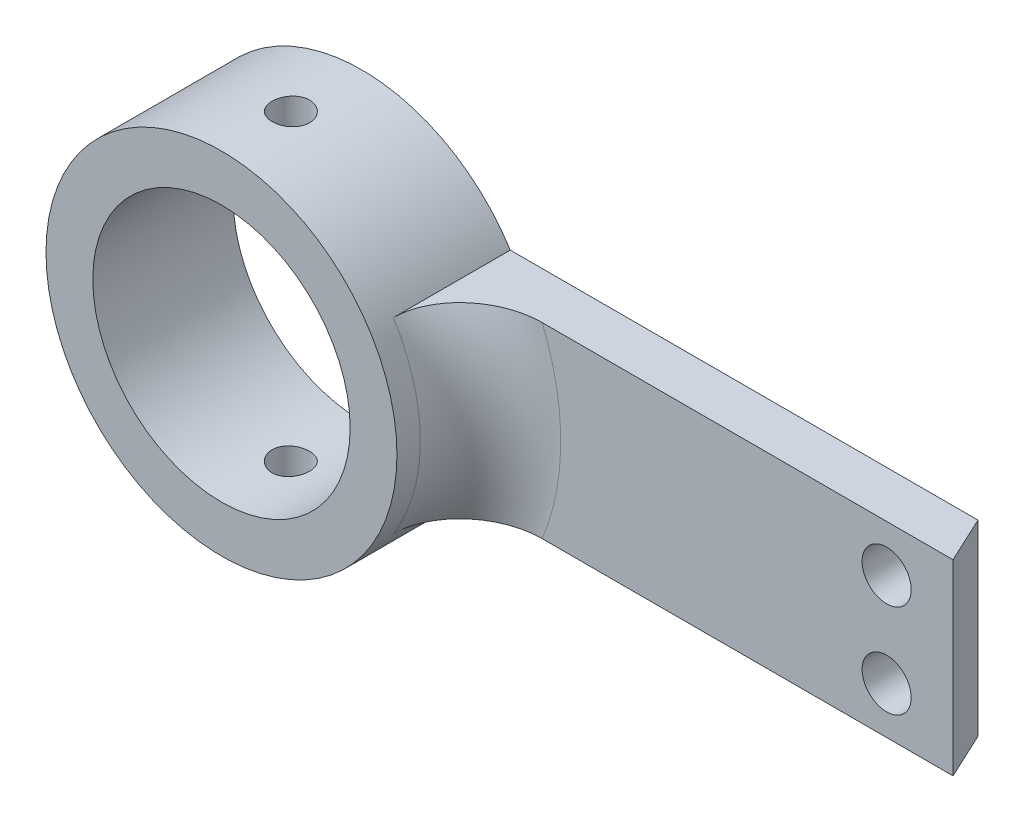
ISO-10303-21;
HEADER;
FILE_DESCRIPTION(('STEP AP214'),'2;1');
FILE_NAME('part.step','',(''),(''),'','','');
FILE_SCHEMA(('AUTOMOTIVE_DESIGN { 1 0 10303 214 1 1 1 1 }'));
ENDSEC;
DATA;
#1=APPLICATION_CONTEXT('core data for automotive mechanical design processes');
#2=APPLICATION_PROTOCOL_DEFINITION('international standard','automotive_design',2000,#1);
#3=PRODUCT_CONTEXT('',#1,'mechanical');
#4=PRODUCT('Part','Part','',(#3));
#5=PRODUCT_RELATED_PRODUCT_CATEGORY('part','',(#4));
#6=PRODUCT_DEFINITION_FORMATION('','',#4);
#7=PRODUCT_DEFINITION_CONTEXT('part definition',#1,'design');
#8=PRODUCT_DEFINITION('design','',#6,#7);
#9=PRODUCT_DEFINITION_SHAPE('','',#8);
#10=(LENGTH_UNIT() NAMED_UNIT(*) SI_UNIT(.MILLI.,.METRE.));
#11=(NAMED_UNIT(*) PLANE_ANGLE_UNIT() SI_UNIT($,.RADIAN.));
#12=(NAMED_UNIT(*) SI_UNIT($,.STERADIAN.) SOLID_ANGLE_UNIT());
#13=UNCERTAINTY_MEASURE_WITH_UNIT(LENGTH_MEASURE(1.E-05),#10,'distance_accuracy_value','');
#14=(GEOMETRIC_REPRESENTATION_CONTEXT(3) GLOBAL_UNCERTAINTY_ASSIGNED_CONTEXT((#13)) GLOBAL_UNIT_ASSIGNED_CONTEXT((#10,
#11,#12)) REPRESENTATION_CONTEXT('',''));
#15=CARTESIAN_POINT('',(0.,0.,0.));
#16=DIRECTION('',(0.,0.,1.));
#17=DIRECTION('',(1.,0.,0.));
#18=AXIS2_PLACEMENT_3D('',#15,#16,#17);
#19=CARTESIAN_POINT('',(21.9969620581679,8.,0.));
#20=DIRECTION('',(0.,0.,-1.));
#21=DIRECTION('',(-1.,0.,0.));
#22=AXIS2_PLACEMENT_3D('',#19,#20,#21);
#23=PLANE('',#22);
#24=CARTESIAN_POINT('',(24.4295773744779,2.,0.));
#25=DIRECTION('',(0.,0.,1.));
#26=DIRECTION('',(1.,0.,0.));
#27=AXIS2_PLACEMENT_3D('',#24,#25,#26);
#28=CIRCLE('',#27,1.05);
#29=CARTESIAN_POINT('',(25.4795773744779,2.,0.));
#30=VERTEX_POINT('',#29);
#31=EDGE_CURVE('E231',#30,#30,#28,.T.);
#32=ORIENTED_EDGE('',*,*,#31,.F.);
#33=EDGE_LOOP('',(#32));
#34=FACE_BOUND('',#33,.T.);
#35=CARTESIAN_POINT('',(24.4295773744779,6.,0.));
#36=DIRECTION('',(0.,0.,1.));
#37=DIRECTION('',(1.,0.,0.));
#38=AXIS2_PLACEMENT_3D('',#35,#36,#37);
#39=CIRCLE('',#38,1.05);
#40=CARTESIAN_POINT('',(25.4795773744779,6.,0.));
#41=VERTEX_POINT('',#40);
#42=EDGE_CURVE('E179',#41,#41,#39,.T.);
#43=ORIENTED_EDGE('',*,*,#42,.F.);
#44=EDGE_LOOP('',(#43));
#45=FACE_BOUND('',#44,.T.);
#46=DIRECTION('',(1.,0.,0.));
#47=VECTOR('',#46,1.);
#48=CARTESIAN_POINT('',(0.,8.,0.));
#49=LINE('',#48,#47);
#50=CARTESIAN_POINT('',(9.7082439194738,8.,0.));
#51=VERTEX_POINT('',#50);
#52=CARTESIAN_POINT('',(27.2670300453605,8.,0.));
#53=VERTEX_POINT('',#52);
#54=EDGE_CURVE('E122',#51,#53,#49,.T.);
#55=ORIENTED_EDGE('',*,*,#54,.F.);
#56=CARTESIAN_POINT('',(0.,4.,0.));
#57=DIRECTION('',(0.,0.,-1.));
#58=DIRECTION('',(-1.,0.,0.));
#59=AXIS2_PLACEMENT_3D('',#56,#57,#58);
#60=CIRCLE('',#59,10.5);
#61=CARTESIAN_POINT('',(9.7082439194738,0.,0.));
#62=VERTEX_POINT('',#61);
#63=EDGE_CURVE('E138',#51,#62,#60,.T.);
#64=ORIENTED_EDGE('',*,*,#63,.T.);
#65=DIRECTION('',(1.,0.,0.));
#66=VECTOR('',#65,1.);
#67=CARTESIAN_POINT('',(21.9969620581679,0.,0.));
#68=LINE('',#67,#66);
#69=CARTESIAN_POINT('',(27.2670300453605,0.,0.));
#70=VERTEX_POINT('',#69);
#71=EDGE_CURVE('E97',#62,#70,#68,.T.);
#72=ORIENTED_EDGE('',*,*,#71,.T.);
#73=DIRECTION('',(0.,-1.,0.));
#74=VECTOR('',#73,1.);
#75=CARTESIAN_POINT('',(27.2670300453605,8.,0.));
#76=LINE('',#75,#74);
#77=EDGE_CURVE('E120',#53,#70,#76,.T.);
#78=ORIENTED_EDGE('',*,*,#77,.F.);
#79=EDGE_LOOP('',(#55,#64,#72,#78));
#80=FACE_BOUND('',#79,.T.);
#81=ADVANCED_FACE('F40',(#34,#45,#80),#23,.F.);
#82=CARTESIAN_POINT('',(26.3344147290505,8.,-2.));
#83=DIRECTION('',(-0.906307787036651,0.,0.422618261740697));
#84=DIRECTION('',(0.422618261740697,0.,0.906307787036651));
#85=AXIS2_PLACEMENT_3D('',#82,#83,#84);
#86=PLANE('',#85);
#87=DIRECTION('',(-0.422618261740697,0.,-0.906307787036651));
#88=VECTOR('',#87,1.);
#89=CARTESIAN_POINT('',(26.3344147290505,0.,-2.));
#90=LINE('',#89,#88);
#91=CARTESIAN_POINT('',(26.3344147290505,0.,-2.));
#92=VERTEX_POINT('',#91);
#93=EDGE_CURVE('E128',#70,#92,#90,.T.);
#94=ORIENTED_EDGE('',*,*,#93,.T.);
#95=DIRECTION('',(0.,-1.,0.));
#96=VECTOR('',#95,1.);
#97=CARTESIAN_POINT('',(26.3344147290505,8.,-2.));
#98=LINE('',#97,#96);
#99=CARTESIAN_POINT('',(26.3344147290505,8.,-2.));
#100=VERTEX_POINT('',#99);
#101=EDGE_CURVE('E116',#100,#92,#98,.T.);
#102=ORIENTED_EDGE('',*,*,#101,.F.);
#103=DIRECTION('',(-0.422618261740697,0.,-0.906307787036651));
#104=VECTOR('',#103,1.);
#105=CARTESIAN_POINT('',(26.3344147290505,8.,-2.));
#106=LINE('',#105,#104);
#107=EDGE_CURVE('E113',#53,#100,#106,.T.);
#108=ORIENTED_EDGE('',*,*,#107,.F.);
#109=ORIENTED_EDGE('',*,*,#77,.T.);
#110=EDGE_LOOP('',(#94,#102,#108,#109));
#111=FACE_BOUND('',#110,.T.);
#112=ADVANCED_FACE('F216',(#111),#86,.F.);
#113=CARTESIAN_POINT('',(0.,8.,-2.));
#114=DIRECTION('',(0.,0.,1.));
#115=DIRECTION('',(1.,0.,0.));
#116=AXIS2_PLACEMENT_3D('',#113,#114,#115);
#117=PLANE('',#116);
#118=CARTESIAN_POINT('',(24.4295773744779,2.,-2.));
#119=DIRECTION('',(0.,0.,1.));
#120=DIRECTION('',(1.,0.,0.));
#121=AXIS2_PLACEMENT_3D('',#118,#119,#120);
#122=CIRCLE('',#121,1.05);
#123=CARTESIAN_POINT('',(25.4795773744779,2.,-2.));
#124=VERTEX_POINT('',#123);
#125=EDGE_CURVE('E149',#124,#124,#122,.T.);
#126=ORIENTED_EDGE('',*,*,#125,.T.);
#127=EDGE_LOOP('',(#126));
#128=FACE_BOUND('',#127,.T.);
#129=CARTESIAN_POINT('',(24.4295773744779,6.,-2.));
#130=DIRECTION('',(0.,0.,1.));
#131=DIRECTION('',(1.,0.,0.));
#132=AXIS2_PLACEMENT_3D('',#129,#130,#131);
#133=CIRCLE('',#132,1.05);
#134=CARTESIAN_POINT('',(25.4795773744779,6.,-2.));
#135=VERTEX_POINT('',#134);
#136=EDGE_CURVE('E236',#135,#135,#133,.T.);
#137=ORIENTED_EDGE('',*,*,#136,.T.);
#138=EDGE_LOOP('',(#137));
#139=FACE_BOUND('',#138,.T.);
#140=CARTESIAN_POINT('',(0.,4.,-2.));
#141=DIRECTION('',(0.,0.,1.));
#142=DIRECTION('',(1.,0.,0.));
#143=AXIS2_PLACEMENT_3D('',#140,#141,#142);
#144=CIRCLE('',#143,5.5);
#145=CARTESIAN_POINT('',(5.5,4.,-2.));
#146=VERTEX_POINT('',#145);
#147=EDGE_CURVE('E109',#146,#146,#144,.T.);
#148=ORIENTED_EDGE('',*,*,#147,.T.);
#149=EDGE_LOOP('',(#148));
#150=FACE_BOUND('',#149,.T.);
#151=DIRECTION('',(-1.,0.,0.));
#152=VECTOR('',#151,1.);
#153=CARTESIAN_POINT('',(0.,0.,-2.));
#154=LINE('',#153,#152);
#155=CARTESIAN_POINT('',(6.34428877022476,0.,-2.));
#156=VERTEX_POINT('',#155);
#157=EDGE_CURVE('E107',#92,#156,#154,.T.);
#158=ORIENTED_EDGE('',*,*,#157,.T.);
#159=CARTESIAN_POINT('',(0.,4.,-2.));
#160=DIRECTION('',(0.,0.,-1.));
#161=DIRECTION('',(-1.,0.,0.));
#162=AXIS2_PLACEMENT_3D('',#159,#160,#161);
#163=CIRCLE('',#162,7.5);
#164=CARTESIAN_POINT('',(6.34428877022476,8.,-2.));
#165=VERTEX_POINT('',#164);
#166=EDGE_CURVE('E92',#156,#165,#163,.T.);
#167=ORIENTED_EDGE('',*,*,#166,.T.);
#168=DIRECTION('',(-1.,0.,0.));
#169=VECTOR('',#168,1.);
#170=CARTESIAN_POINT('',(0.,8.,-2.));
#171=LINE('',#170,#169);
#172=EDGE_CURVE('E105',#100,#165,#171,.T.);
#173=ORIENTED_EDGE('',*,*,#172,.F.);
#174=ORIENTED_EDGE('',*,*,#101,.T.);
#175=EDGE_LOOP('',(#158,#167,#173,#174));
#176=FACE_BOUND('',#175,.T.);
#177=ADVANCED_FACE('F103',(#128,#139,#150,#176),#117,.F.);
#178=CARTESIAN_POINT('',(0.,8.,0.));
#179=DIRECTION('',(0.,1.,0.));
#180=DIRECTION('',(0.,0.,1.));
#181=AXIS2_PLACEMENT_3D('',#178,#179,#180);
#182=PLANE('',#181);
#183=DIRECTION('',(0.,0.,-1.));
#184=VECTOR('',#183,1.);
#185=CARTESIAN_POINT('',(6.34428877022476,8.,4.));
#186=LINE('',#185,#184);
#187=CARTESIAN_POINT('',(6.34428877022476,8.,3.));
#188=VERTEX_POINT('',#187);
#189=EDGE_CURVE('E69',#188,#165,#186,.T.);
#190=ORIENTED_EDGE('',*,*,#189,.F.);
#191=CARTESIAN_POINT('',(6.34428877022476,8.,3.));
#192=CARTESIAN_POINT('',(6.34426880098098,8.,2.9238039582987));
#193=CARTESIAN_POINT('',(6.34771991349651,8.,2.84761835397723));
#194=CARTESIAN_POINT('',(6.36141079038242,8.,2.69589731644003));
#195=CARTESIAN_POINT('',(6.37164709268638,8.,2.62036157154087));
#196=CARTESIAN_POINT('',(6.39868066472819,8.,2.47090231230737));
#197=CARTESIAN_POINT('',(6.41544158237933,8.,2.39697222068501));
#198=CARTESIAN_POINT('',(6.45523972427884,8.,2.2508370341983));
#199=CARTESIAN_POINT('',(6.47827748657316,8.,2.17863208778935));
#200=CARTESIAN_POINT('',(6.55623081892531,8.,1.96557992490763));
#201=CARTESIAN_POINT('',(6.62006035428883,8.,1.82789950460488));
#202=CARTESIAN_POINT('',(6.76833812155291,8.,1.5641062211634));
#203=CARTESIAN_POINT('',(6.85281356340393,8.,1.43800892805915));
#204=CARTESIAN_POINT('',(7.04608589137458,8.,1.19050844193509));
#205=CARTESIAN_POINT('',(7.15622667152038,8.,1.07015644568584));
#206=CARTESIAN_POINT('',(7.39286730747052,8.,0.846858436570008));
#207=CARTESIAN_POINT('',(7.51937243236137,8.,0.743918054738328));
#208=CARTESIAN_POINT('',(7.80424295806232,8.,0.54352215350391));
#209=CARTESIAN_POINT('',(7.96458718489003,8.,0.448872118080962));
#210=CARTESIAN_POINT('',(8.2979551200242,8.,0.28546734433864));
#211=CARTESIAN_POINT('',(8.47098252569134,8.,0.216720193297492));
#212=CARTESIAN_POINT('',(8.81964431932084,8.,0.108422230047425));
#213=CARTESIAN_POINT('',(8.99499582624757,8.,0.0679681278944319));
#214=CARTESIAN_POINT('',(9.26091941365943,8.,0.02731099358867));
#215=CARTESIAN_POINT('',(9.35005859614701,8.,0.0170959188926687));
#216=CARTESIAN_POINT('',(9.52886690443123,8.,0.00344094034331538));
#217=CARTESIAN_POINT('',(9.61853610681258,8.,2.04086062140692E-06));
#218=CARTESIAN_POINT('',(9.7082439194738,8.,0.));
#219=B_SPLINE_CURVE_WITH_KNOTS('',3,(#191,#192,#193,#194,#195,#196,#197,#198,#199,#200,#201,
#202,#203,#204,#205,#206,#207,#208,#209,#210,#211,#212,#213,#214,#215,#216,#217,#218),
.UNSPECIFIED.,.F.,.F.,(4,2,2,2,2,2,2,2,2,2,2,2,2,4),(0.,0.228492801186375,0.456869106153082,
0.683990808933797,0.911131986527806,1.36422157707618,1.81791156092455,2.30543263567651,
2.79311107784805,3.3493478992041,3.90574752284235,4.44345425303313,4.71239827575114,
4.98138215859137),.UNSPECIFIED.);
#220=EDGE_CURVE('E11',#188,#51,#219,.T.);
#221=ORIENTED_EDGE('',*,*,#220,.T.);
#222=ORIENTED_EDGE('',*,*,#54,.T.);
#223=ORIENTED_EDGE('',*,*,#107,.T.);
#224=ORIENTED_EDGE('',*,*,#172,.T.);
#225=EDGE_LOOP('',(#190,#221,#222,#223,#224));
#226=FACE_BOUND('',#225,.T.);
#227=ADVANCED_FACE('F111',(#226),#182,.T.);
#228=CARTESIAN_POINT('',(0.,0.,0.));
#229=DIRECTION('',(0.,1.,0.));
#230=DIRECTION('',(0.,0.,1.));
#231=AXIS2_PLACEMENT_3D('',#228,#229,#230);
#232=PLANE('',#231);
#233=ORIENTED_EDGE('',*,*,#71,.F.);
#234=CARTESIAN_POINT('',(9.7082439194738,0.,0.));
#235=CARTESIAN_POINT('',(9.60744155538898,0.,3.16822478303017E-06));
#236=CARTESIAN_POINT('',(9.50669506014358,0.,0.0043449175917044));
#237=CARTESIAN_POINT('',(9.30595050178385,0.,0.0215665147792781));
#238=CARTESIAN_POINT('',(9.20595231460294,0.,0.0344449140502964));
#239=CARTESIAN_POINT('',(8.90818030768916,0.,0.0856449678846151));
#240=CARTESIAN_POINT('',(8.71242689702874,0.,0.136532049158632));
#241=CARTESIAN_POINT('',(8.33222141715054,0.,0.270126644931071));
#242=CARTESIAN_POINT('',(8.14776817759333,0.,0.352830857702964));
#243=CARTESIAN_POINT('',(7.79535163591049,0.,0.548171686138273));
#244=CARTESIAN_POINT('',(7.62739213894134,0.,0.660815186772975));
#245=CARTESIAN_POINT('',(7.31483563984825,0.,0.913150821534328));
#246=CARTESIAN_POINT('',(7.17007982003278,0.,1.05264330375482));
#247=CARTESIAN_POINT('',(6.97450743270249,0.,1.28019176289316));
#248=CARTESIAN_POINT('',(6.91288162091984,0.,1.35914241921893));
#249=CARTESIAN_POINT('',(6.79770095335641,0.,1.52270164530912));
#250=CARTESIAN_POINT('',(6.74414062178065,0.,1.60730631960662));
#251=CARTESIAN_POINT('',(6.65094208617005,0.,1.77282599969324));
#252=CARTESIAN_POINT('',(6.61044606320407,0.,1.85325889638368));
#253=CARTESIAN_POINT('',(6.53742560597495,0.,2.01761932239888));
#254=CARTESIAN_POINT('',(6.5048958850535,0.,2.10154449064951));
#255=CARTESIAN_POINT('',(6.44847749319137,0.,2.27201771603555));
#256=CARTESIAN_POINT('',(6.42456697463605,0.,2.3585585302743));
#257=CARTESIAN_POINT('',(6.38580170145009,0.,2.53359739652587));
#258=CARTESIAN_POINT('',(6.37093964441726,0.,2.62209381036901));
#259=CARTESIAN_POINT('',(6.35528206595212,0.,2.75907131432818));
#260=CARTESIAN_POINT('',(6.35116037951649,0.,2.80719311421701));
#261=CARTESIAN_POINT('',(6.34566435502208,0.,2.90354027776031));
#262=CARTESIAN_POINT('',(6.34428700888319,0.,2.95176546995629));
#263=CARTESIAN_POINT('',(6.34428877022476,0.,3.));
#264=B_SPLINE_CURVE_WITH_KNOTS('',3,(#234,#235,#236,#237,#238,#239,#240,#241,#242,#243,#244,
#245,#246,#247,#248,#249,#250,#251,#252,#253,#254,#255,#256,#257,#258,#259,#260,#261,#262,#263),
.UNSPECIFIED.,.F.,.F.,(4,2,2,2,2,2,2,2,2,2,2,2,2,2,4),(0.,0.302207519481956,0.604363771713545,
1.20807758981375,1.81172877623107,2.41551890123834,3.01498148723606,3.31505038686796,
3.61491463700685,3.88467875936363,4.15426337068725,4.42315976314506,4.69183885883162,
4.83666330138831,4.98132891389424),.UNSPECIFIED.);
#265=CARTESIAN_POINT('',(6.34428877022476,0.,3.));
#266=VERTEX_POINT('',#265);
#267=EDGE_CURVE('E55',#62,#266,#264,.T.);
#268=ORIENTED_EDGE('',*,*,#267,.T.);
#269=DIRECTION('',(0.,0.,-1.));
#270=VECTOR('',#269,1.);
#271=CARTESIAN_POINT('',(6.34428877022476,0.,4.));
#272=LINE('',#271,#270);
#273=EDGE_CURVE('E62',#266,#156,#272,.T.);
#274=ORIENTED_EDGE('',*,*,#273,.T.);
#275=ORIENTED_EDGE('',*,*,#157,.F.);
#276=ORIENTED_EDGE('',*,*,#93,.F.);
#277=EDGE_LOOP('',(#233,#268,#274,#275,#276));
#278=FACE_BOUND('',#277,.T.);
#279=ADVANCED_FACE('F188',(#278),#232,.F.);
#280=CARTESIAN_POINT('',(0.,4.,4.));
#281=DIRECTION('',(0.,0.,-1.));
#282=DIRECTION('',(-1.,0.,0.));
#283=AXIS2_PLACEMENT_3D('',#280,#281,#282);
#284=CYLINDRICAL_SURFACE('',#283,7.5);
#285=CARTESIAN_POINT('',(0.,11.5,0.23404325445311));
#286=CARTESIAN_POINT('',(-0.0447998129181648,11.4999994538945,0.234045186177031));
#287=CARTESIAN_POINT('',(-0.0896288479237268,11.4995943364043,0.237819097611481));
#288=CARTESIAN_POINT('',(-0.178042953355282,11.4980172007317,0.252816361759118));
#289=CARTESIAN_POINT('',(-0.221626616978633,11.4968443484679,0.2640478166782));
#290=CARTESIAN_POINT('',(-0.306256938523538,11.4938640721529,0.293628498425029));
#291=CARTESIAN_POINT('',(-0.34730515362798,11.4920570422413,0.311973305064899));
#292=CARTESIAN_POINT('',(-0.425731283864999,11.4880102027846,0.355251088490596));
#293=CARTESIAN_POINT('',(-0.463109902233583,11.4857704764059,0.380182799578347));
#294=CARTESIAN_POINT('',(-0.533296501999639,11.4810987456168,0.436035384384502));
#295=CARTESIAN_POINT('',(-0.566087443419809,11.4786660743484,0.46697761749219));
#296=CARTESIAN_POINT('',(-0.626021336531889,11.4738881107754,0.533927249531145));
#297=CARTESIAN_POINT('',(-0.653164020746643,11.4715428226131,0.569934888202952));
#298=CARTESIAN_POINT('',(-0.701092132443197,11.4671984324469,0.646100986735963));
#299=CARTESIAN_POINT('',(-0.721861991527757,11.4652001833191,0.686269295954688));
#300=CARTESIAN_POINT('',(-0.756355464374449,11.4617845475475,0.769548356097058));
#301=CARTESIAN_POINT('',(-0.770079274826251,11.4603671446897,0.812659024846997));
#302=CARTESIAN_POINT('',(-0.790040213810513,11.4582798172347,0.900424370112223));
#303=CARTESIAN_POINT('',(-0.79630575228243,11.4576070568485,0.945072516618264));
#304=CARTESIAN_POINT('',(-0.801260134575633,11.4570764208921,1.0347913355949));
#305=CARTESIAN_POINT('',(-0.799949203309618,11.4572185211322,1.07986199548324));
#306=CARTESIAN_POINT('',(-0.789811250510876,11.4582989591884,1.16895008714858));
#307=CARTESIAN_POINT('',(-0.781015315462047,11.4592340037177,1.2129711020425));
#308=CARTESIAN_POINT('',(-0.756205441889778,11.4617898333443,1.29890853791635));
#309=CARTESIAN_POINT('',(-0.740191393806682,11.4634106288501,1.34082492694062));
#310=CARTESIAN_POINT('',(-0.701365782296716,11.4671591158655,1.42146106083742));
#311=CARTESIAN_POINT('',(-0.678540496489262,11.4692878289083,1.46017414908148));
#312=CARTESIAN_POINT('',(-0.626750184638496,11.473811456023,1.53323189261894));
#313=CARTESIAN_POINT('',(-0.59778495402924,11.4762063789629,1.56757640230238));
#314=CARTESIAN_POINT('',(-0.534363672653895,11.4810072481914,1.63110266661949));
#315=CARTESIAN_POINT('',(-0.499880787452069,11.4834131894629,1.66025763824662));
#316=CARTESIAN_POINT('',(-0.426496025397202,11.4879536820522,1.71236940303693));
#317=CARTESIAN_POINT('',(-0.387594142493961,11.4900882329982,1.73532618771382));
#318=CARTESIAN_POINT('',(-0.306456595637891,11.4938462827474,1.77438911285432));
#319=CARTESIAN_POINT('',(-0.264220234671297,11.4954696743461,1.79049381649233));
#320=CARTESIAN_POINT('',(-0.177621761140337,11.4980214351687,1.81537539837336));
#321=CARTESIAN_POINT('',(-0.133259720988649,11.4989498280505,1.82415252604773));
#322=CARTESIAN_POINT('',(-0.0439010162812204,11.5000039396166,1.8340956479394));
#323=CARTESIAN_POINT('',(0.00109149350699552,11.5001335542418,1.83529858494674));
#324=CARTESIAN_POINT('',(0.0906374700509233,11.499585969711,1.83015632143269));
#325=CARTESIAN_POINT('',(0.135190943560214,11.4989087829856,1.82381123720383));
#326=CARTESIAN_POINT('',(0.22248692716507,11.4968261621817,1.80378370434639));
#327=CARTESIAN_POINT('',(0.26523346818736,11.4954224529142,1.79011863116456));
#328=CARTESIAN_POINT('',(0.347827664743481,11.4920441791686,1.75585692881965));
#329=CARTESIAN_POINT('',(0.387675246843858,11.4900696002361,1.73526012414336));
#330=CARTESIAN_POINT('',(0.463506931520318,11.4857605582479,1.68762855783319));
#331=CARTESIAN_POINT('',(0.499475768585791,11.4834247554097,1.66056961597895));
#332=CARTESIAN_POINT('',(0.566374221762663,11.4786594509869,1.60081643540619));
#333=CARTESIAN_POINT('',(0.597303693548268,11.4762299467212,1.56812203534514));
#334=CARTESIAN_POINT('',(0.653374403215884,11.4715392624503,1.49786443415679));
#335=CARTESIAN_POINT('',(0.678491334759634,11.4692788151175,1.46028177892443));
#336=CARTESIAN_POINT('',(0.722056692887733,11.4651935633925,1.38141007009778));
#337=CARTESIAN_POINT('',(0.740505221416027,11.4633687523405,1.34012107317664));
#338=CARTESIAN_POINT('',(0.770169722513556,11.4603660753898,1.25509086862175));
#339=CARTESIAN_POINT('',(0.781399970695727,11.4591869332383,1.21135468827426));
#340=CARTESIAN_POINT('',(0.796355365223174,11.4576052186895,1.12260415839808));
#341=CARTESIAN_POINT('',(0.800080759250585,11.4572026206639,1.07758985110105));
#342=CARTESIAN_POINT('',(0.799916988163489,11.4572201710394,0.987802490814611));
#343=CARTESIAN_POINT('',(0.796066004450825,11.4576361939754,0.943029362504873));
#344=CARTESIAN_POINT('',(0.780939044709405,11.4592352969936,0.854770123177213));
#345=CARTESIAN_POINT('',(0.769663061933583,11.4604183777729,0.811284013328839));
#346=CARTESIAN_POINT('',(0.740017079589486,11.4634171168606,0.72683469436594));
#347=CARTESIAN_POINT('',(0.721648381680041,11.4652326590933,0.68587102393044));
#348=CARTESIAN_POINT('',(0.678342254682738,11.4692919808533,0.607601892210556));
#349=CARTESIAN_POINT('',(0.65340483284637,11.4715357599078,0.570296426887789));
#350=CARTESIAN_POINT('',(0.597526077554603,11.4762122930404,0.500207050498499));
#351=CARTESIAN_POINT('',(0.56655627002217,11.4786459091759,0.46744589708035));
#352=CARTESIAN_POINT('',(0.499549320808266,11.4834200868048,0.407569419824028));
#353=CARTESIAN_POINT('',(0.463510972179032,11.4857606259634,0.38045544454804));
#354=CARTESIAN_POINT('',(0.387276897945913,11.4900919375985,0.332581242275777));
#355=CARTESIAN_POINT('',(0.347069719960656,11.4920817037274,0.311839173434423));
#356=CARTESIAN_POINT('',(0.263746726886726,11.4954765792198,0.277429133106941));
#357=CARTESIAN_POINT('',(0.220634223555271,11.4968823416085,0.263753256102013));
#358=CARTESIAN_POINT('',(0.147735487332117,11.49860108552,0.247240697209247));
#359=CARTESIAN_POINT('',(0.118413832458365,11.4991232056389,0.242298502916954));
#360=CARTESIAN_POINT('',(0.0593990666236742,11.4998228430992,0.235699149063286));
#361=CARTESIAN_POINT('',(0.0297059574659149,11.5000003621128,0.234041973561407));
#362=CARTESIAN_POINT('',(0.,11.5,0.23404325445311));
#363=B_SPLINE_CURVE_WITH_KNOTS('',3,(#285,#286,#287,#288,#289,#290,#291,#292,#293,#294,#295,
#296,#297,#298,#299,#300,#301,#302,#303,#304,#305,#306,#307,#308,#309,#310,#311,#312,#313,#314,
#315,#316,#317,#318,#319,#320,#321,#322,#323,#324,#325,#326,#327,#328,#329,#330,#331,#332,#333,
#334,#335,#336,#337,#338,#339,#340,#341,#342,#343,#344,#345,#346,#347,#348,#349,#350,#351,#352,
#353,#354,#355,#356,#357,#358,#359,#360,#361,#362),.UNSPECIFIED.,.T.,.F.,(4,2,2,2,2,2,2,2,2,2,2,
2,2,2,2,2,2,2,2,2,2,2,2,2,2,2,2,2,2,2,2,2,2,2,2,2,2,2,4),(0.,0.134290956217292,
0.268728051334078,0.403081741691365,0.537409634242641,0.672223917155451,0.807044582840464,
0.942192031433328,1.07733570719493,1.2119629313055,1.34658615893513,1.48065298715692,
1.61472185037177,1.74906266262775,1.88340795145097,2.01842766535212,2.15344756411557,
2.28849576151543,2.42353936167464,2.55792377893288,2.69230612575416,2.82637089379802,
2.96043905665151,3.09501696456802,3.22959872607509,3.36473349017926,3.49986618830847,
3.63473080505873,3.76959097080928,3.90377324511698,4.03795564135574,4.17211342406516,
4.3062710586728,4.44107800037442,4.57591709753912,4.7111369582753,4.84620520828159,
4.93525157993965,5.02429751950049),.UNSPECIFIED.);
#364=CARTESIAN_POINT('',(0.,11.5,0.23404325445311));
#365=VERTEX_POINT('',#364);
#366=EDGE_CURVE('E178',#365,#365,#363,.T.);
#367=ORIENTED_EDGE('',*,*,#366,.F.);
#368=EDGE_LOOP('',(#367));
#369=FACE_BOUND('',#368,.T.);
#370=CARTESIAN_POINT('',(0.,-3.5,0.23404325445311));
#371=CARTESIAN_POINT('',(0.044799812918164,-3.49999945389454,0.234045186177031));
#372=CARTESIAN_POINT('',(0.089628847923726,-3.4995943364043,0.237819097611481));
#373=CARTESIAN_POINT('',(0.178042953355281,-3.4980172007317,0.252816361759118));
#374=CARTESIAN_POINT('',(0.221626616978633,-3.49684434846789,0.2640478166782));
#375=CARTESIAN_POINT('',(0.306256938523537,-3.49386407215285,0.293628498425028));
#376=CARTESIAN_POINT('',(0.347305153627979,-3.49205704224132,0.311973305064899));
#377=CARTESIAN_POINT('',(0.425731283864999,-3.48801020278465,0.355251088490595));
#378=CARTESIAN_POINT('',(0.463109902233583,-3.48577047640593,0.380182799578346));
#379=CARTESIAN_POINT('',(0.533296501999638,-3.48109874561677,0.436035384384501));
#380=CARTESIAN_POINT('',(0.566087443419808,-3.47866607434842,0.46697761749219));
#381=CARTESIAN_POINT('',(0.626021336531889,-3.4738881107754,0.533927249531144));
#382=CARTESIAN_POINT('',(0.653164020746643,-3.47154282261315,0.569934888202952));
#383=CARTESIAN_POINT('',(0.701092132443197,-3.46719843244687,0.646100986735963));
#384=CARTESIAN_POINT('',(0.721861991527757,-3.4652001833191,0.686269295954687));
#385=CARTESIAN_POINT('',(0.756355464374449,-3.46178454754753,0.769548356097057));
#386=CARTESIAN_POINT('',(0.770079274826251,-3.46036714468968,0.812659024846996));
#387=CARTESIAN_POINT('',(0.790040213810513,-3.45827981723472,0.900424370112223));
#388=CARTESIAN_POINT('',(0.79630575228243,-3.45760705684848,0.945072516618263));
#389=CARTESIAN_POINT('',(0.801260134575633,-3.45707642089205,1.0347913355949));
#390=CARTESIAN_POINT('',(0.799949203309618,-3.45721852113217,1.07986199548324));
#391=CARTESIAN_POINT('',(0.789811250510876,-3.45829895918836,1.16895008714858));
#392=CARTESIAN_POINT('',(0.781015315462048,-3.4592340037177,1.2129711020425));
#393=CARTESIAN_POINT('',(0.756205441889778,-3.46178983334428,1.29890853791635));
#394=CARTESIAN_POINT('',(0.740191393806683,-3.46341062885013,1.34082492694062));
#395=CARTESIAN_POINT('',(0.701365782296717,-3.46715911586552,1.42146106083742));
#396=CARTESIAN_POINT('',(0.678540496489263,-3.46928782890833,1.46017414908148));
#397=CARTESIAN_POINT('',(0.626750184638497,-3.47381145602298,1.53323189261894));
#398=CARTESIAN_POINT('',(0.597784954029241,-3.47620637896293,1.56757640230238));
#399=CARTESIAN_POINT('',(0.534363672653896,-3.48100724819137,1.63110266661949));
#400=CARTESIAN_POINT('',(0.49988078745207,-3.48341318946293,1.66025763824662));
#401=CARTESIAN_POINT('',(0.426496025397203,-3.48795368205215,1.71236940303693));
#402=CARTESIAN_POINT('',(0.387594142493962,-3.49008823299824,1.73532618771382));
#403=CARTESIAN_POINT('',(0.306456595637892,-3.49384628274744,1.77438911285432));
#404=CARTESIAN_POINT('',(0.264220234671298,-3.49546967434606,1.79049381649233));
#405=CARTESIAN_POINT('',(0.177621761140338,-3.49802143516875,1.81537539837336));
#406=CARTESIAN_POINT('',(0.13325972098865,-3.49894982805052,1.82415252604773));
#407=CARTESIAN_POINT('',(0.0439010162812214,-3.50000393961664,1.8340956479394));
#408=CARTESIAN_POINT('',(-0.00109149350699455,-3.50013355424176,1.83529858494674));
#409=CARTESIAN_POINT('',(-0.0906374700509224,-3.49958596971102,1.83015632143269));
#410=CARTESIAN_POINT('',(-0.135190943560213,-3.49890878298556,1.82381123720383));
#411=CARTESIAN_POINT('',(-0.222486927165069,-3.49682616218166,1.80378370434639));
#412=CARTESIAN_POINT('',(-0.265233468187359,-3.49542245291418,1.79011863116456));
#413=CARTESIAN_POINT('',(-0.34782766474348,-3.49204417916859,1.75585692881965));
#414=CARTESIAN_POINT('',(-0.387675246843858,-3.49006960023609,1.73526012414336));
#415=CARTESIAN_POINT('',(-0.463506931520317,-3.48576055824791,1.68762855783319));
#416=CARTESIAN_POINT('',(-0.49947576858579,-3.48342475540966,1.66056961597895));
#417=CARTESIAN_POINT('',(-0.566374221762662,-3.47865945098688,1.60081643540619));
#418=CARTESIAN_POINT('',(-0.597303693548267,-3.47622994672122,1.56812203534514));
#419=CARTESIAN_POINT('',(-0.653374403215883,-3.47153926245032,1.49786443415679));
#420=CARTESIAN_POINT('',(-0.678491334759633,-3.46927881511752,1.46028177892444));
#421=CARTESIAN_POINT('',(-0.722056692887733,-3.46519356339248,1.38141007009778));
#422=CARTESIAN_POINT('',(-0.740505221416026,-3.46336875234055,1.34012107317664));
#423=CARTESIAN_POINT('',(-0.770169722513555,-3.46036607538978,1.25509086862175));
#424=CARTESIAN_POINT('',(-0.781399970695727,-3.45918693323834,1.21135468827426));
#425=CARTESIAN_POINT('',(-0.796355365223174,-3.45760521868951,1.12260415839808));
#426=CARTESIAN_POINT('',(-0.800080759250585,-3.45720262066391,1.07758985110105));
#427=CARTESIAN_POINT('',(-0.799916988163489,-3.45722017103939,0.987802490814613));
#428=CARTESIAN_POINT('',(-0.796066004450825,-3.45763619397537,0.943029362504874));
#429=CARTESIAN_POINT('',(-0.780939044709405,-3.45923529699362,0.854770123177214));
#430=CARTESIAN_POINT('',(-0.769663061933583,-3.46041837777291,0.81128401332884));
#431=CARTESIAN_POINT('',(-0.740017079589486,-3.46341711686056,0.726834694365941));
#432=CARTESIAN_POINT('',(-0.721648381680041,-3.46523265909329,0.685871023930441));
#433=CARTESIAN_POINT('',(-0.678342254682739,-3.46929198085329,0.607601892210557));
#434=CARTESIAN_POINT('',(-0.653404832846371,-3.47153575990781,0.57029642688779));
#435=CARTESIAN_POINT('',(-0.597526077554604,-3.4762122930404,0.5002070504985));
#436=CARTESIAN_POINT('',(-0.566556270022171,-3.47864590917593,0.467445897080351));
#437=CARTESIAN_POINT('',(-0.499549320808267,-3.48342008680481,0.407569419824029));
#438=CARTESIAN_POINT('',(-0.463510972179033,-3.4857606259634,0.38045544454804));
#439=CARTESIAN_POINT('',(-0.387276897945914,-3.49009193759848,0.332581242275778));
#440=CARTESIAN_POINT('',(-0.347069719960657,-3.49208170372744,0.311839173434423));
#441=CARTESIAN_POINT('',(-0.263746726886728,-3.49547657921977,0.277429133106942));
#442=CARTESIAN_POINT('',(-0.220634223555272,-3.49688234160852,0.263753256102013));
#443=CARTESIAN_POINT('',(-0.147735487332118,-3.49860108551999,0.247240697209247));
#444=CARTESIAN_POINT('',(-0.118413832458366,-3.49912320563885,0.242298502916954));
#445=CARTESIAN_POINT('',(-0.059399066623675,-3.49982284309917,0.235699149063287));
#446=CARTESIAN_POINT('',(-0.0297059574659157,-3.5000003621128,0.234041973561407));
#447=CARTESIAN_POINT('',(0.,-3.5,0.23404325445311));
#448=B_SPLINE_CURVE_WITH_KNOTS('',3,(#370,#371,#372,#373,#374,#375,#376,#377,#378,#379,#380,
#381,#382,#383,#384,#385,#386,#387,#388,#389,#390,#391,#392,#393,#394,#395,#396,#397,#398,#399,
#400,#401,#402,#403,#404,#405,#406,#407,#408,#409,#410,#411,#412,#413,#414,#415,#416,#417,#418,
#419,#420,#421,#422,#423,#424,#425,#426,#427,#428,#429,#430,#431,#432,#433,#434,#435,#436,#437,
#438,#439,#440,#441,#442,#443,#444,#445,#446,#447),.UNSPECIFIED.,.T.,.F.,(4,2,2,2,2,2,2,2,2,2,2,
2,2,2,2,2,2,2,2,2,2,2,2,2,2,2,2,2,2,2,2,2,2,2,2,2,2,2,4),(0.,0.134290956217292,
0.268728051334078,0.403081741691365,0.537409634242641,0.672223917155452,0.807044582840465,
0.942192031433328,1.07733570719493,1.2119629313055,1.34658615893513,1.48065298715692,
1.61472185037177,1.74906266262775,1.88340795145097,2.01842766535212,2.15344756411557,
2.28849576151543,2.42353936167464,2.55792377893288,2.69230612575416,2.82637089379802,
2.96043905665151,3.09501696456802,3.22959872607509,3.36473349017926,3.49986618830847,
3.63473080505873,3.76959097080928,3.90377324511698,4.03795564135574,4.17211342406516,
4.3062710586728,4.44107800037442,4.57591709753912,4.7111369582753,4.84620520828159,
4.93525157993965,5.02429751950049),.UNSPECIFIED.);
#449=CARTESIAN_POINT('',(0.,-3.5,0.23404325445311));
#450=VERTEX_POINT('',#449);
#451=EDGE_CURVE('E170',#450,#450,#448,.T.);
#452=ORIENTED_EDGE('',*,*,#451,.F.);
#453=EDGE_LOOP('',(#452));
#454=FACE_BOUND('',#453,.T.);
#455=CARTESIAN_POINT('',(0.,4.,4.));
#456=DIRECTION('',(0.,0.,-1.));
#457=DIRECTION('',(-1.,0.,0.));
#458=AXIS2_PLACEMENT_3D('',#455,#456,#457);
#459=CIRCLE('',#458,7.5);
#460=CARTESIAN_POINT('',(-7.5,4.,4.));
#461=VERTEX_POINT('',#460);
#462=EDGE_CURVE('E98',#461,#461,#459,.T.);
#463=ORIENTED_EDGE('',*,*,#462,.T.);
#464=EDGE_LOOP('',(#463));
#465=FACE_BOUND('',#464,.T.);
#466=ORIENTED_EDGE('',*,*,#273,.F.);
#467=CARTESIAN_POINT('',(0.,4.,3.));
#468=DIRECTION('',(0.,0.,-1.));
#469=DIRECTION('',(-1.,0.,0.));
#470=AXIS2_PLACEMENT_3D('',#467,#468,#469);
#471=CIRCLE('',#470,7.5);
#472=EDGE_CURVE('E94',#266,#188,#471,.F.);
#473=ORIENTED_EDGE('',*,*,#472,.T.);
#474=ORIENTED_EDGE('',*,*,#189,.T.);
#475=ORIENTED_EDGE('',*,*,#166,.F.);
#476=EDGE_LOOP('',(#466,#473,#474,#475));
#477=FACE_BOUND('',#476,.T.);
#478=ADVANCED_FACE('F91',(#369,#454,#465,#477),#284,.T.);
#479=CARTESIAN_POINT('',(0.,4.,4.));
#480=DIRECTION('',(0.,0.,-1.));
#481=DIRECTION('',(-1.,0.,0.));
#482=AXIS2_PLACEMENT_3D('',#479,#480,#481);
#483=PLANE('',#482);
#484=CARTESIAN_POINT('',(0.,4.,4.));
#485=DIRECTION('',(0.,0.,1.));
#486=DIRECTION('',(1.,0.,0.));
#487=AXIS2_PLACEMENT_3D('',#484,#485,#486);
#488=CIRCLE('',#487,5.5);
#489=CARTESIAN_POINT('',(5.5,4.,4.));
#490=VERTEX_POINT('',#489);
#491=EDGE_CURVE('E266',#490,#490,#488,.T.);
#492=ORIENTED_EDGE('',*,*,#491,.F.);
#493=EDGE_LOOP('',(#492));
#494=FACE_BOUND('',#493,.T.);
#495=ORIENTED_EDGE('',*,*,#462,.F.);
#496=EDGE_LOOP('',(#495));
#497=FACE_BOUND('',#496,.T.);
#498=ADVANCED_FACE('F187',(#494,#497),#483,.F.);
#499=CARTESIAN_POINT('',(0.,4.,-2.));
#500=DIRECTION('',(0.,0.,1.));
#501=DIRECTION('',(1.,0.,0.));
#502=AXIS2_PLACEMENT_3D('',#499,#500,#501);
#503=CYLINDRICAL_SURFACE('',#502,5.5);
#504=CARTESIAN_POINT('',(0.,9.5,0.23404325445311));
#505=CARTESIAN_POINT('',(-0.0446834085438383,9.49999929921932,0.234045108966273));
#506=CARTESIAN_POINT('',(-0.0893931350294791,9.49944975546251,0.2377995280886));
#507=CARTESIAN_POINT('',(-0.177563973315573,9.49731039981189,0.252714824580982));
#508=CARTESIAN_POINT('',(-0.22102380791749,9.49571956072858,0.263883015446857));
#509=CARTESIAN_POINT('',(-0.305406005645267,9.49167647525996,0.293286006169775));
#510=CARTESIAN_POINT('',(-0.346330220085715,9.48922486627365,0.311515578111708));
#511=CARTESIAN_POINT('',(-0.424532210135268,9.48373148619056,0.354511333780371));
#512=CARTESIAN_POINT('',(-0.461810514135954,9.48068980080309,0.379276568382075));
#513=CARTESIAN_POINT('',(-0.531943544746347,9.47432973136888,0.434835078356604));
#514=CARTESIAN_POINT('',(-0.564767535900352,9.47100965765033,0.465666962584712));
#515=CARTESIAN_POINT('',(-0.624795095753018,9.46448030610228,0.532400506589567));
#516=CARTESIAN_POINT('',(-0.651998348729396,9.46127103450508,0.568302450965897));
#517=CARTESIAN_POINT('',(-0.700130928219431,9.45531022755958,0.644362255829476));
#518=CARTESIAN_POINT('',(-0.721030691875009,9.4525608752048,0.684539010347524));
#519=CARTESIAN_POINT('',(-0.755774128878151,9.4478541409294,0.767879145118523));
#520=CARTESIAN_POINT('',(-0.769618163685059,9.4458967184399,0.811042372248182));
#521=CARTESIAN_POINT('',(-0.789762084478119,9.44301200703377,0.898807701788537));
#522=CARTESIAN_POINT('',(-0.796114463506446,9.44207755366323,0.943397516235734));
#523=CARTESIAN_POINT('',(-0.801257334683262,9.44132280391109,1.03301926827517));
#524=CARTESIAN_POINT('',(-0.8000482354774,9.44150244732025,1.07805118184369));
#525=CARTESIAN_POINT('',(-0.790145407177923,9.44294904061759,1.1669090038647));
#526=CARTESIAN_POINT('',(-0.781510016214107,9.44420751537211,1.21074157165137));
#527=CARTESIAN_POINT('',(-0.757090995298955,9.44765673876432,1.29632890892108));
#528=CARTESIAN_POINT('',(-0.74130717420894,9.44984751233025,1.33808362281219));
#529=CARTESIAN_POINT('',(-0.702978268919052,9.4549238997548,1.41850821407466));
#530=CARTESIAN_POINT('',(-0.680408349820677,9.45781205803458,1.45716608840517));
#531=CARTESIAN_POINT('',(-0.629165627322457,9.46395593069204,1.53016793799648));
#532=CARTESIAN_POINT('',(-0.60049244695925,9.46721166776712,1.56451164658763));
#533=CARTESIAN_POINT('',(-0.537536299090536,9.47376135187755,1.62824847979262));
#534=CARTESIAN_POINT('',(-0.50320314902939,9.47705537048161,1.65759205183351));
#535=CARTESIAN_POINT('',(-0.430073028170989,9.48328201382527,1.71010808314416));
#536=CARTESIAN_POINT('',(-0.391276039878429,9.48621463714837,1.73328051822594));
#537=CARTESIAN_POINT('',(-0.310277519497469,9.49139086686158,1.77279855106695));
#538=CARTESIAN_POINT('',(-0.268074165511738,9.49363410140665,1.78914046626028));
#539=CARTESIAN_POINT('',(-0.181482272026725,9.49717565083513,1.8144912257994));
#540=CARTESIAN_POINT('',(-0.137093871549535,9.49847402575184,1.82350053603931));
#541=CARTESIAN_POINT('',(-0.0478197335770264,9.49997164289173,1.83386477850689));
#542=CARTESIAN_POINT('',(-0.00294206606579237,9.50018067088805,1.83528786165783));
#543=CARTESIAN_POINT('',(0.0864112370135964,9.49950263807624,1.83061994436111));
#544=CARTESIAN_POINT('',(0.130886884226218,9.49861560911841,1.82452916225869));
#545=CARTESIAN_POINT('',(0.217968256030995,9.49585118641866,1.80506307193949));
#546=CARTESIAN_POINT('',(0.26058152693792,9.49397828923398,1.79172082881827));
#547=CARTESIAN_POINT('',(0.342966158533023,9.48945151169322,1.75816532625586));
#548=CARTESIAN_POINT('',(0.382737392621306,9.48679759657323,1.73795176095896));
#549=CARTESIAN_POINT('',(0.458609586389357,9.48097954172551,1.6910665442978));
#550=CARTESIAN_POINT('',(0.494683464637942,9.4778120231835,1.66435149519168));
#551=CARTESIAN_POINT('',(0.561860055599564,9.4713302167806,1.60528226200174));
#552=CARTESIAN_POINT('',(0.592962497342341,9.46801592093212,1.57292777073851));
#553=CARTESIAN_POINT('',(0.649560111729236,9.46158323227856,1.5031952873485));
#554=CARTESIAN_POINT('',(0.67500969633859,9.45846656749534,1.46578011072746));
#555=CARTESIAN_POINT('',(0.719262678570641,9.45281220937667,1.38716596814893));
#556=CARTESIAN_POINT('',(0.738066247210349,9.45027450114396,1.34596709958877));
#557=CARTESIAN_POINT('',(0.768422158114248,9.44607776354416,1.26109316445259));
#558=CARTESIAN_POINT('',(0.77999882323402,9.44441578978416,1.21742694913074));
#559=CARTESIAN_POINT('',(0.795649914438099,9.44215075160076,1.12874417910801));
#560=CARTESIAN_POINT('',(0.799724825092595,9.44154761878244,1.08372771181657));
#561=CARTESIAN_POINT('',(0.800245719629453,9.44147100015125,0.994076495376494));
#562=CARTESIAN_POINT('',(0.796763368649916,9.44198690255965,0.949442155082466));
#563=CARTESIAN_POINT('',(0.782421811842236,9.44406721127834,0.861400956018209));
#564=CARTESIAN_POINT('',(0.771562615088905,9.44563161629879,0.817994095738034));
#565=CARTESIAN_POINT('',(0.742800404784917,9.44962903438294,0.733657862931637));
#566=CARTESIAN_POINT('',(0.724902100704958,9.4520614665979,0.692726855033725));
#567=CARTESIAN_POINT('',(0.682576838244825,9.45752161613603,0.614437163453143));
#568=CARTESIAN_POINT('',(0.658149685527515,9.46054935117823,0.577078586152082));
#569=CARTESIAN_POINT('',(0.603198629209785,9.46689318824319,0.506629646320856));
#570=CARTESIAN_POINT('',(0.572621569985458,9.47021165120974,0.473580953996638));
#571=CARTESIAN_POINT('',(0.506350919839396,9.47674310183151,0.413057982560077));
#572=CARTESIAN_POINT('',(0.470656138491499,9.47995606473219,0.385585004008188));
#573=CARTESIAN_POINT('',(0.39494737515874,9.48593334666497,0.33686759597724));
#574=CARTESIAN_POINT('',(0.354912054715781,9.48869526493083,0.315656040226231));
#575=CARTESIAN_POINT('',(0.271826458996321,9.49343562350326,0.280289564378212));
#576=CARTESIAN_POINT('',(0.228779390479509,9.4954148826433,0.266127265172787));
#577=CARTESIAN_POINT('',(0.154610982531071,9.49791013555151,0.248509046502472));
#578=CARTESIAN_POINT('',(0.123949542966635,9.49868985061717,0.243092566798401));
#579=CARTESIAN_POINT('',(0.0621963166243284,9.49973502383601,0.235859045707325));
#580=CARTESIAN_POINT('',(0.0311045347298286,9.50000048781993,0.234041963509313));
#581=CARTESIAN_POINT('',(0.,9.5,0.23404325445311));
#582=B_SPLINE_CURVE_WITH_KNOTS('',3,(#504,#505,#506,#507,#508,#509,#510,#511,#512,#513,#514,
#515,#516,#517,#518,#519,#520,#521,#522,#523,#524,#525,#526,#527,#528,#529,#530,#531,#532,#533,
#534,#535,#536,#537,#538,#539,#540,#541,#542,#543,#544,#545,#546,#547,#548,#549,#550,#551,#552,
#553,#554,#555,#556,#557,#558,#559,#560,#561,#562,#563,#564,#565,#566,#567,#568,#569,#570,#571,
#572,#573,#574,#575,#576,#577,#578,#579,#580,#581),.UNSPECIFIED.,.T.,.F.,(4,2,2,2,2,2,2,2,2,2,2,
2,2,2,2,2,2,2,2,2,2,2,2,2,2,2,2,2,2,2,2,2,2,2,2,2,2,2,4),(0.,0.133936575185564,
0.268005472103274,0.401975299831022,0.535925682826269,0.670757849126023,0.805597587020886,
0.941060215914209,1.07651590446771,1.2110167248599,1.34551027647497,1.47895684943459,
1.61240699077316,1.74635158664916,1.88030445791463,2.01551606664358,2.15072820533102,
2.28601314775108,2.4212894938562,2.5553485103761,2.68940363137006,2.82285255654624,
2.95630742256798,3.09067879331993,3.22505748554492,3.36048342861533,3.49590588661642,
3.6308700743778,3.76582554392302,3.89950683370152,4.03318795902891,4.16677979757214,
4.30037561304125,4.435180014035,4.5700158227177,4.70554744484639,4.84093689355294,
4.93417244175149,5.02740693281245),.UNSPECIFIED.);
#583=CARTESIAN_POINT('',(0.,9.5,0.23404325445311));
#584=VERTEX_POINT('',#583);
#585=EDGE_CURVE('E148',#584,#584,#582,.T.);
#586=ORIENTED_EDGE('',*,*,#585,.T.);
#587=EDGE_LOOP('',(#586));
#588=FACE_BOUND('',#587,.T.);
#589=CARTESIAN_POINT('',(0.,-1.5,0.23404325445311));
#590=CARTESIAN_POINT('',(0.0446834085438383,-1.49999929921932,0.234045108966273));
#591=CARTESIAN_POINT('',(0.089393135029479,-1.49944975546251,0.2377995280886));
#592=CARTESIAN_POINT('',(0.177563973315573,-1.49731039981189,0.252714824580982));
#593=CARTESIAN_POINT('',(0.22102380791749,-1.49571956072858,0.263883015446857));
#594=CARTESIAN_POINT('',(0.305406005645267,-1.49167647525996,0.293286006169775));
#595=CARTESIAN_POINT('',(0.346330220085715,-1.48922486627365,0.311515578111708));
#596=CARTESIAN_POINT('',(0.424532210135268,-1.48373148619055,0.354511333780371));
#597=CARTESIAN_POINT('',(0.461810514135954,-1.48068980080309,0.379276568382075));
#598=CARTESIAN_POINT('',(0.531943544746347,-1.47432973136888,0.434835078356604));
#599=CARTESIAN_POINT('',(0.564767535900352,-1.47100965765033,0.465666962584712));
#600=CARTESIAN_POINT('',(0.624795095753018,-1.46448030610228,0.532400506589567));
#601=CARTESIAN_POINT('',(0.651998348729396,-1.46127103450508,0.568302450965897));
#602=CARTESIAN_POINT('',(0.700130928219431,-1.45531022755958,0.644362255829476));
#603=CARTESIAN_POINT('',(0.721030691875009,-1.4525608752048,0.684539010347524));
#604=CARTESIAN_POINT('',(0.755774128878151,-1.44785414092939,0.767879145118524));
#605=CARTESIAN_POINT('',(0.769618163685059,-1.4458967184399,0.811042372248183));
#606=CARTESIAN_POINT('',(0.789762084478119,-1.44301200703377,0.898807701788538));
#607=CARTESIAN_POINT('',(0.796114463506446,-1.44207755366323,0.943397516235735));
#608=CARTESIAN_POINT('',(0.801257334683262,-1.44132280391109,1.03301926827517));
#609=CARTESIAN_POINT('',(0.8000482354774,-1.44150244732025,1.07805118184369));
#610=CARTESIAN_POINT('',(0.790145407177923,-1.44294904061759,1.16690900386471));
#611=CARTESIAN_POINT('',(0.781510016214107,-1.44420751537211,1.21074157165137));
#612=CARTESIAN_POINT('',(0.757090995298955,-1.44765673876432,1.29632890892108));
#613=CARTESIAN_POINT('',(0.74130717420894,-1.44984751233025,1.33808362281219));
#614=CARTESIAN_POINT('',(0.702978268919052,-1.4549238997548,1.41850821407466));
#615=CARTESIAN_POINT('',(0.680408349820677,-1.45781205803458,1.45716608840517));
#616=CARTESIAN_POINT('',(0.629165627322457,-1.46395593069204,1.53016793799648));
#617=CARTESIAN_POINT('',(0.60049244695925,-1.46721166776712,1.56451164658763));
#618=CARTESIAN_POINT('',(0.537536299090536,-1.47376135187756,1.62824847979262));
#619=CARTESIAN_POINT('',(0.50320314902939,-1.47705537048161,1.65759205183351));
#620=CARTESIAN_POINT('',(0.430073028170989,-1.48328201382528,1.71010808314416));
#621=CARTESIAN_POINT('',(0.391276039878429,-1.48621463714837,1.73328051822594));
#622=CARTESIAN_POINT('',(0.310277519497469,-1.49139086686158,1.77279855106695));
#623=CARTESIAN_POINT('',(0.268074165511738,-1.49363410140665,1.78914046626028));
#624=CARTESIAN_POINT('',(0.181482272026725,-1.49717565083513,1.8144912257994));
#625=CARTESIAN_POINT('',(0.137093871549535,-1.49847402575184,1.82350053603931));
#626=CARTESIAN_POINT('',(0.0478197335770262,-1.49997164289173,1.83386477850689));
#627=CARTESIAN_POINT('',(0.00294206606579227,-1.50018067088805,1.83528786165783));
#628=CARTESIAN_POINT('',(-0.0864112370135964,-1.49950263807624,1.83061994436111));
#629=CARTESIAN_POINT('',(-0.130886884226218,-1.49861560911841,1.82452916225869));
#630=CARTESIAN_POINT('',(-0.217968256030995,-1.49585118641866,1.80506307193949));
#631=CARTESIAN_POINT('',(-0.260581526937921,-1.49397828923398,1.79172082881827));
#632=CARTESIAN_POINT('',(-0.342966158533024,-1.48945151169322,1.75816532625586));
#633=CARTESIAN_POINT('',(-0.382737392621307,-1.48679759657323,1.73795176095896));
#634=CARTESIAN_POINT('',(-0.458609586389357,-1.48097954172551,1.6910665442978));
#635=CARTESIAN_POINT('',(-0.494683464637942,-1.4778120231835,1.66435149519168));
#636=CARTESIAN_POINT('',(-0.561860055599564,-1.4713302167806,1.60528226200174));
#637=CARTESIAN_POINT('',(-0.592962497342342,-1.46801592093212,1.57292777073851));
#638=CARTESIAN_POINT('',(-0.649560111729236,-1.46158323227856,1.5031952873485));
#639=CARTESIAN_POINT('',(-0.67500969633859,-1.45846656749534,1.46578011072746));
#640=CARTESIAN_POINT('',(-0.719262678570641,-1.45281220937667,1.38716596814893));
#641=CARTESIAN_POINT('',(-0.738066247210349,-1.45027450114396,1.34596709958878));
#642=CARTESIAN_POINT('',(-0.768422158114248,-1.44607776354416,1.26109316445259));
#643=CARTESIAN_POINT('',(-0.77999882323402,-1.44441578978416,1.21742694913074));
#644=CARTESIAN_POINT('',(-0.795649914438099,-1.44215075160076,1.12874417910801));
#645=CARTESIAN_POINT('',(-0.799724825092595,-1.44154761878244,1.08372771181657));
#646=CARTESIAN_POINT('',(-0.800245719629453,-1.44147100015125,0.994076495376493));
#647=CARTESIAN_POINT('',(-0.796763368649916,-1.44198690255965,0.949442155082465));
#648=CARTESIAN_POINT('',(-0.782421811842236,-1.44406721127834,0.861400956018209));
#649=CARTESIAN_POINT('',(-0.771562615088905,-1.44563161629878,0.817994095738033));
#650=CARTESIAN_POINT('',(-0.742800404784917,-1.44962903438294,0.733657862931637));
#651=CARTESIAN_POINT('',(-0.724902100704958,-1.4520614665979,0.692726855033725));
#652=CARTESIAN_POINT('',(-0.682576838244825,-1.45752161613604,0.614437163453144));
#653=CARTESIAN_POINT('',(-0.658149685527515,-1.46054935117823,0.577078586152082));
#654=CARTESIAN_POINT('',(-0.603198629209785,-1.46689318824318,0.506629646320857));
#655=CARTESIAN_POINT('',(-0.572621569985458,-1.47021165120974,0.473580953996638));
#656=CARTESIAN_POINT('',(-0.506350919839396,-1.47674310183151,0.413057982560077));
#657=CARTESIAN_POINT('',(-0.470656138491499,-1.47995606473219,0.385585004008189));
#658=CARTESIAN_POINT('',(-0.39494737515874,-1.48593334666497,0.33686759597724));
#659=CARTESIAN_POINT('',(-0.354912054715781,-1.48869526493083,0.315656040226231));
#660=CARTESIAN_POINT('',(-0.271826458996321,-1.49343562350326,0.280289564378212));
#661=CARTESIAN_POINT('',(-0.228779390479509,-1.4954148826433,0.266127265172787));
#662=CARTESIAN_POINT('',(-0.154610982531071,-1.49791013555151,0.248509046502472));
#663=CARTESIAN_POINT('',(-0.123949542966635,-1.49868985061717,0.243092566798401));
#664=CARTESIAN_POINT('',(-0.0621963166243284,-1.49973502383601,0.235859045707325));
#665=CARTESIAN_POINT('',(-0.0311045347298286,-1.50000048781993,0.234041963509313));
#666=CARTESIAN_POINT('',(0.,-1.5,0.23404325445311));
#667=B_SPLINE_CURVE_WITH_KNOTS('',3,(#589,#590,#591,#592,#593,#594,#595,#596,#597,#598,#599,
#600,#601,#602,#603,#604,#605,#606,#607,#608,#609,#610,#611,#612,#613,#614,#615,#616,#617,#618,
#619,#620,#621,#622,#623,#624,#625,#626,#627,#628,#629,#630,#631,#632,#633,#634,#635,#636,#637,
#638,#639,#640,#641,#642,#643,#644,#645,#646,#647,#648,#649,#650,#651,#652,#653,#654,#655,#656,
#657,#658,#659,#660,#661,#662,#663,#664,#665,#666),.UNSPECIFIED.,.T.,.F.,(4,2,2,2,2,2,2,2,2,2,2,
2,2,2,2,2,2,2,2,2,2,2,2,2,2,2,2,2,2,2,2,2,2,2,2,2,2,2,4),(0.,0.133936575185564,
0.268005472103274,0.401975299831022,0.535925682826269,0.670757849126023,0.805597587020887,
0.941060215914209,1.07651590446771,1.2110167248599,1.34551027647497,1.47895684943459,
1.61240699077316,1.74635158664916,1.88030445791463,2.01551606664358,2.15072820533102,
2.28601314775108,2.4212894938562,2.5553485103761,2.68940363137006,2.82285255654624,
2.95630742256798,3.09067879331993,3.22505748554492,3.36048342861533,3.49590588661642,
3.63087007437781,3.76582554392303,3.89950683370152,4.03318795902891,4.16677979757214,
4.30037561304125,4.435180014035,4.5700158227177,4.70554744484639,4.84093689355294,
4.93417244175149,5.02740693281245),.UNSPECIFIED.);
#668=CARTESIAN_POINT('',(0.,-1.5,0.23404325445311));
#669=VERTEX_POINT('',#668);
#670=EDGE_CURVE('E139',#669,#669,#667,.T.);
#671=ORIENTED_EDGE('',*,*,#670,.T.);
#672=EDGE_LOOP('',(#671));
#673=FACE_BOUND('',#672,.T.);
#674=ORIENTED_EDGE('',*,*,#147,.F.);
#675=EDGE_LOOP('',(#674));
#676=FACE_BOUND('',#675,.T.);
#677=ORIENTED_EDGE('',*,*,#491,.T.);
#678=EDGE_LOOP('',(#677));
#679=FACE_BOUND('',#678,.T.);
#680=ADVANCED_FACE('F154',(#588,#673,#676,#679),#503,.F.);
#681=CARTESIAN_POINT('',(0.,11.5,1.03404325445311));
#682=DIRECTION('',(0.,-1.,0.));
#683=DIRECTION('',(0.,0.,-1.));
#684=AXIS2_PLACEMENT_3D('',#681,#682,#683);
#685=CYLINDRICAL_SURFACE('',#684,0.8);
#686=ORIENTED_EDGE('',*,*,#451,.T.);
#687=EDGE_LOOP('',(#686));
#688=FACE_BOUND('',#687,.T.);
#689=ORIENTED_EDGE('',*,*,#670,.F.);
#690=EDGE_LOOP('',(#689));
#691=FACE_BOUND('',#690,.T.);
#692=ADVANCED_FACE('F161',(#688,#691),#685,.F.);
#693=ORIENTED_EDGE('',*,*,#366,.T.);
#694=EDGE_LOOP('',(#693));
#695=FACE_BOUND('',#694,.T.);
#696=ORIENTED_EDGE('',*,*,#585,.F.);
#697=EDGE_LOOP('',(#696));
#698=FACE_BOUND('',#697,.T.);
#699=ADVANCED_FACE('F157',(#695,#698),#685,.F.);
#700=CARTESIAN_POINT('',(0.,4.,3.));
#701=DIRECTION('',(0.,0.,-1.));
#702=DIRECTION('',(-1.,0.,0.));
#703=AXIS2_PLACEMENT_3D('',#700,#701,#702);
#704=TOROIDAL_SURFACE('',#703,10.5,3.);
#705=ORIENTED_EDGE('',*,*,#220,.F.);
#706=ORIENTED_EDGE('',*,*,#472,.F.);
#707=ORIENTED_EDGE('',*,*,#267,.F.);
#708=ORIENTED_EDGE('',*,*,#63,.F.);
#709=EDGE_LOOP('',(#705,#706,#707,#708));
#710=FACE_BOUND('',#709,.T.);
#711=ADVANCED_FACE('F42',(#710),#704,.F.);
#712=CARTESIAN_POINT('',(24.4295773744779,6.,-2.));
#713=DIRECTION('',(0.,0.,1.));
#714=DIRECTION('',(1.,0.,0.));
#715=AXIS2_PLACEMENT_3D('',#712,#713,#714);
#716=CYLINDRICAL_SURFACE('',#715,1.05);
#717=ORIENTED_EDGE('',*,*,#136,.F.);
#718=EDGE_LOOP('',(#717));
#719=FACE_BOUND('',#718,.T.);
#720=ORIENTED_EDGE('',*,*,#42,.T.);
#721=EDGE_LOOP('',(#720));
#722=FACE_BOUND('',#721,.T.);
#723=ADVANCED_FACE('F163',(#719,#722),#716,.F.);
#724=CARTESIAN_POINT('',(24.4295773744779,2.,-2.));
#725=DIRECTION('',(0.,0.,1.));
#726=DIRECTION('',(1.,0.,0.));
#727=AXIS2_PLACEMENT_3D('',#724,#725,#726);
#728=CYLINDRICAL_SURFACE('',#727,1.05);
#729=ORIENTED_EDGE('',*,*,#125,.F.);
#730=EDGE_LOOP('',(#729));
#731=FACE_BOUND('',#730,.T.);
#732=ORIENTED_EDGE('',*,*,#31,.T.);
#733=EDGE_LOOP('',(#732));
#734=FACE_BOUND('',#733,.T.);
#735=ADVANCED_FACE('F248',(#731,#734),#728,.F.);
#736=CLOSED_SHELL('',(#81,#112,#177,#227,#279,#478,#498,#680,#692,#699,#711,#723,#735));
#737=MANIFOLD_SOLID_BREP('B2',#736);
#738=ADVANCED_BREP_SHAPE_REPRESENTATION('',(#18,#737),#14);
#739=SHAPE_DEFINITION_REPRESENTATION(#9,#738);
ENDSEC;
END-ISO-10303-21;
